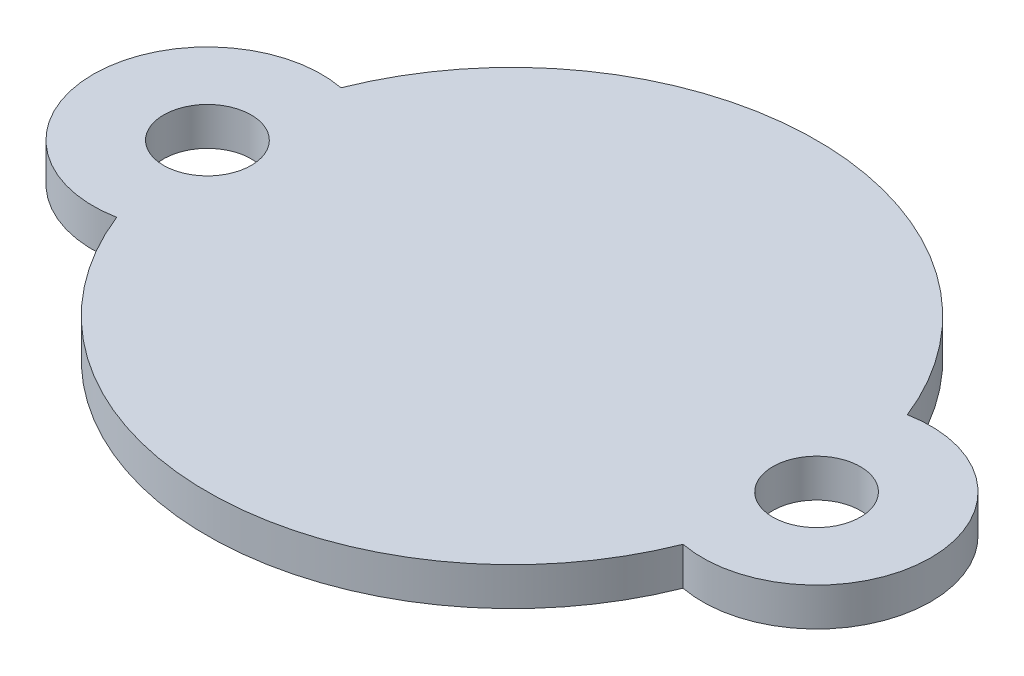
ISO-10303-21;
HEADER;
FILE_DESCRIPTION(('STEP AP214'),'2;1');
FILE_NAME('part.step','',(''),(''),'','','');
FILE_SCHEMA(('AUTOMOTIVE_DESIGN { 1 0 10303 214 1 1 1 1 }'));
ENDSEC;
DATA;
#1=APPLICATION_CONTEXT('core data for automotive mechanical design processes');
#2=APPLICATION_PROTOCOL_DEFINITION('international standard','automotive_design',2000,#1);
#3=PRODUCT_CONTEXT('',#1,'mechanical');
#4=PRODUCT('Part','Part','',(#3));
#5=PRODUCT_RELATED_PRODUCT_CATEGORY('part','',(#4));
#6=PRODUCT_DEFINITION_FORMATION('','',#4);
#7=PRODUCT_DEFINITION_CONTEXT('part definition',#1,'design');
#8=PRODUCT_DEFINITION('design','',#6,#7);
#9=PRODUCT_DEFINITION_SHAPE('','',#8);
#10=(LENGTH_UNIT() NAMED_UNIT(*) SI_UNIT(.MILLI.,.METRE.));
#11=(NAMED_UNIT(*) PLANE_ANGLE_UNIT() SI_UNIT($,.RADIAN.));
#12=(NAMED_UNIT(*) SI_UNIT($,.STERADIAN.) SOLID_ANGLE_UNIT());
#13=UNCERTAINTY_MEASURE_WITH_UNIT(LENGTH_MEASURE(1.E-05),#10,'distance_accuracy_value','');
#14=(GEOMETRIC_REPRESENTATION_CONTEXT(3) GLOBAL_UNCERTAINTY_ASSIGNED_CONTEXT((#13)) GLOBAL_UNIT_ASSIGNED_CONTEXT((#10,
#11,#12)) REPRESENTATION_CONTEXT('',''));
#15=CARTESIAN_POINT('',(0.,0.,0.));
#16=DIRECTION('',(0.,0.,1.));
#17=DIRECTION('',(1.,0.,0.));
#18=AXIS2_PLACEMENT_3D('',#15,#16,#17);
#19=CARTESIAN_POINT('',(-8.,1.,0.));
#20=DIRECTION('',(0.,-1.,0.));
#21=DIRECTION('',(0.,0.,-1.));
#22=AXIS2_PLACEMENT_3D('',#19,#20,#21);
#23=CYLINDRICAL_SURFACE('',#22,3.);
#24=CARTESIAN_POINT('',(-8.,0.,0.));
#25=DIRECTION('',(0.,1.,0.));
#26=DIRECTION('',(0.,0.,1.));
#27=AXIS2_PLACEMENT_3D('',#24,#25,#26);
#28=CIRCLE('',#27,3.);
#29=CARTESIAN_POINT('',(-7.4375,0.,-2.94679380853157));
#30=VERTEX_POINT('',#29);
#31=CARTESIAN_POINT('',(-7.4375,0.,2.94679380853157));
#32=VERTEX_POINT('',#31);
#33=EDGE_CURVE('E108',#30,#32,#28,.T.);
#34=ORIENTED_EDGE('',*,*,#33,.T.);
#35=DIRECTION('',(0.,-1.,0.));
#36=VECTOR('',#35,1.);
#37=CARTESIAN_POINT('',(-7.4375,1.,2.94679380853157));
#38=LINE('',#37,#36);
#39=CARTESIAN_POINT('',(-7.4375,1.,2.94679380853157));
#40=VERTEX_POINT('',#39);
#41=EDGE_CURVE('E11',#40,#32,#38,.T.);
#42=ORIENTED_EDGE('',*,*,#41,.F.);
#43=CARTESIAN_POINT('',(-8.,1.,0.));
#44=DIRECTION('',(0.,1.,0.));
#45=DIRECTION('',(0.,0.,1.));
#46=AXIS2_PLACEMENT_3D('',#43,#44,#45);
#47=CIRCLE('',#46,3.);
#48=CARTESIAN_POINT('',(-7.4375,1.,-2.94679380853157));
#49=VERTEX_POINT('',#48);
#50=EDGE_CURVE('E91',#49,#40,#47,.T.);
#51=ORIENTED_EDGE('',*,*,#50,.F.);
#52=DIRECTION('',(0.,-1.,0.));
#53=VECTOR('',#52,1.);
#54=CARTESIAN_POINT('',(-7.4375,1.,-2.94679380853157));
#55=LINE('',#54,#53);
#56=EDGE_CURVE('E107',#49,#30,#55,.T.);
#57=ORIENTED_EDGE('',*,*,#56,.T.);
#58=EDGE_LOOP('',(#34,#42,#51,#57));
#59=FACE_BOUND('',#58,.T.);
#60=ADVANCED_FACE('F39',(#59),#23,.T.);
#61=CARTESIAN_POINT('',(0.,1.,0.));
#62=DIRECTION('',(0.,-1.,0.));
#63=DIRECTION('',(0.,0.,-1.));
#64=AXIS2_PLACEMENT_3D('',#61,#62,#63);
#65=CYLINDRICAL_SURFACE('',#64,8.);
#66=CARTESIAN_POINT('',(0.,0.,0.));
#67=DIRECTION('',(0.,1.,0.));
#68=DIRECTION('',(0.,0.,1.));
#69=AXIS2_PLACEMENT_3D('',#66,#67,#68);
#70=CIRCLE('',#69,8.);
#71=CARTESIAN_POINT('',(7.4375,0.,2.94679380853157));
#72=VERTEX_POINT('',#71);
#73=EDGE_CURVE('E95',#32,#72,#70,.T.);
#74=ORIENTED_EDGE('',*,*,#73,.T.);
#75=DIRECTION('',(0.,-1.,0.));
#76=VECTOR('',#75,1.);
#77=CARTESIAN_POINT('',(7.4375,1.,2.94679380853157));
#78=LINE('',#77,#76);
#79=CARTESIAN_POINT('',(7.4375,1.,2.94679380853157));
#80=VERTEX_POINT('',#79);
#81=EDGE_CURVE('E47',#80,#72,#78,.T.);
#82=ORIENTED_EDGE('',*,*,#81,.F.);
#83=CARTESIAN_POINT('',(0.,1.,0.));
#84=DIRECTION('',(0.,1.,0.));
#85=DIRECTION('',(0.,0.,1.));
#86=AXIS2_PLACEMENT_3D('',#83,#84,#85);
#87=CIRCLE('',#86,8.);
#88=EDGE_CURVE('E85',#40,#80,#87,.T.);
#89=ORIENTED_EDGE('',*,*,#88,.F.);
#90=ORIENTED_EDGE('',*,*,#41,.T.);
#91=EDGE_LOOP('',(#74,#82,#89,#90));
#92=FACE_BOUND('',#91,.T.);
#93=ADVANCED_FACE('F94',(#92),#65,.T.);
#94=CARTESIAN_POINT('',(8.,1.,0.));
#95=DIRECTION('',(0.,-1.,0.));
#96=DIRECTION('',(0.,0.,-1.));
#97=AXIS2_PLACEMENT_3D('',#94,#95,#96);
#98=CYLINDRICAL_SURFACE('',#97,3.);
#99=CARTESIAN_POINT('',(8.,0.,0.));
#100=DIRECTION('',(0.,1.,0.));
#101=DIRECTION('',(0.,0.,1.));
#102=AXIS2_PLACEMENT_3D('',#99,#100,#101);
#103=CIRCLE('',#102,3.);
#104=CARTESIAN_POINT('',(7.4375,0.,-2.94679380853157));
#105=VERTEX_POINT('',#104);
#106=EDGE_CURVE('E72',#72,#105,#103,.T.);
#107=ORIENTED_EDGE('',*,*,#106,.T.);
#108=DIRECTION('',(0.,-1.,0.));
#109=VECTOR('',#108,1.);
#110=CARTESIAN_POINT('',(7.4375,1.,-2.94679380853157));
#111=LINE('',#110,#109);
#112=CARTESIAN_POINT('',(7.4375,1.,-2.94679380853157));
#113=VERTEX_POINT('',#112);
#114=EDGE_CURVE('E96',#113,#105,#111,.T.);
#115=ORIENTED_EDGE('',*,*,#114,.F.);
#116=CARTESIAN_POINT('',(8.,1.,0.));
#117=DIRECTION('',(0.,1.,0.));
#118=DIRECTION('',(0.,0.,1.));
#119=AXIS2_PLACEMENT_3D('',#116,#117,#118);
#120=CIRCLE('',#119,3.);
#121=EDGE_CURVE('E89',#80,#113,#120,.T.);
#122=ORIENTED_EDGE('',*,*,#121,.F.);
#123=ORIENTED_EDGE('',*,*,#81,.T.);
#124=EDGE_LOOP('',(#107,#115,#122,#123));
#125=FACE_BOUND('',#124,.T.);
#126=ADVANCED_FACE('F97',(#125),#98,.T.);
#127=CARTESIAN_POINT('',(-8.,1.,0.));
#128=DIRECTION('',(0.,-1.,0.));
#129=DIRECTION('',(0.,0.,-1.));
#130=AXIS2_PLACEMENT_3D('',#127,#128,#129);
#131=CYLINDRICAL_SURFACE('',#130,1.15);
#132=CARTESIAN_POINT('',(-8.,1.,0.));
#133=DIRECTION('',(0.,1.,0.));
#134=DIRECTION('',(0.,0.,1.));
#135=AXIS2_PLACEMENT_3D('',#132,#133,#134);
#136=CIRCLE('',#135,1.15);
#137=CARTESIAN_POINT('',(-8.,1.,1.15));
#138=VERTEX_POINT('',#137);
#139=EDGE_CURVE('E99',#138,#138,#136,.T.);
#140=ORIENTED_EDGE('',*,*,#139,.T.);
#141=EDGE_LOOP('',(#140));
#142=FACE_BOUND('',#141,.T.);
#143=CARTESIAN_POINT('',(-8.,0.,0.));
#144=DIRECTION('',(0.,1.,0.));
#145=DIRECTION('',(0.,0.,1.));
#146=AXIS2_PLACEMENT_3D('',#143,#144,#145);
#147=CIRCLE('',#146,1.15);
#148=CARTESIAN_POINT('',(-8.,0.,1.15));
#149=VERTEX_POINT('',#148);
#150=EDGE_CURVE('E113',#149,#149,#147,.T.);
#151=ORIENTED_EDGE('',*,*,#150,.F.);
#152=EDGE_LOOP('',(#151));
#153=FACE_BOUND('',#152,.T.);
#154=ADVANCED_FACE('F134',(#142,#153),#131,.F.);
#155=EDGE_CURVE('E78',#105,#30,#70,.T.);
#156=ORIENTED_EDGE('',*,*,#155,.T.);
#157=ORIENTED_EDGE('',*,*,#56,.F.);
#158=EDGE_CURVE('E55',#113,#49,#87,.T.);
#159=ORIENTED_EDGE('',*,*,#158,.F.);
#160=ORIENTED_EDGE('',*,*,#114,.T.);
#161=EDGE_LOOP('',(#156,#157,#159,#160));
#162=FACE_BOUND('',#161,.T.);
#163=ADVANCED_FACE('F120',(#162),#65,.T.);
#164=CARTESIAN_POINT('',(8.,1.,0.));
#165=DIRECTION('',(0.,-1.,0.));
#166=DIRECTION('',(0.,0.,-1.));
#167=AXIS2_PLACEMENT_3D('',#164,#165,#166);
#168=CYLINDRICAL_SURFACE('',#167,1.15);
#169=CARTESIAN_POINT('',(8.,1.,0.));
#170=DIRECTION('',(0.,1.,0.));
#171=DIRECTION('',(0.,0.,1.));
#172=AXIS2_PLACEMENT_3D('',#169,#170,#171);
#173=CIRCLE('',#172,1.15);
#174=CARTESIAN_POINT('',(8.,1.,1.15));
#175=VERTEX_POINT('',#174);
#176=EDGE_CURVE('E104',#175,#175,#173,.T.);
#177=ORIENTED_EDGE('',*,*,#176,.T.);
#178=EDGE_LOOP('',(#177));
#179=FACE_BOUND('',#178,.T.);
#180=CARTESIAN_POINT('',(8.,0.,0.));
#181=DIRECTION('',(0.,1.,0.));
#182=DIRECTION('',(0.,0.,1.));
#183=AXIS2_PLACEMENT_3D('',#180,#181,#182);
#184=CIRCLE('',#183,1.15);
#185=CARTESIAN_POINT('',(8.,0.,1.15));
#186=VERTEX_POINT('',#185);
#187=EDGE_CURVE('E116',#186,#186,#184,.T.);
#188=ORIENTED_EDGE('',*,*,#187,.F.);
#189=EDGE_LOOP('',(#188));
#190=FACE_BOUND('',#189,.T.);
#191=ADVANCED_FACE('F137',(#179,#190),#168,.F.);
#192=CARTESIAN_POINT('',(0.,1.,0.));
#193=DIRECTION('',(0.,1.,0.));
#194=DIRECTION('',(0.,0.,1.));
#195=AXIS2_PLACEMENT_3D('',#192,#193,#194);
#196=PLANE('',#195);
#197=ORIENTED_EDGE('',*,*,#50,.T.);
#198=ORIENTED_EDGE('',*,*,#88,.T.);
#199=ORIENTED_EDGE('',*,*,#121,.T.);
#200=ORIENTED_EDGE('',*,*,#158,.T.);
#201=EDGE_LOOP('',(#197,#198,#199,#200));
#202=FACE_BOUND('',#201,.T.);
#203=ORIENTED_EDGE('',*,*,#139,.F.);
#204=EDGE_LOOP('',(#203));
#205=FACE_BOUND('',#204,.T.);
#206=ORIENTED_EDGE('',*,*,#176,.F.);
#207=EDGE_LOOP('',(#206));
#208=FACE_BOUND('',#207,.T.);
#209=ADVANCED_FACE('F86',(#202,#205,#208),#196,.T.);
#210=CARTESIAN_POINT('',(0.,0.,0.));
#211=DIRECTION('',(0.,1.,0.));
#212=DIRECTION('',(0.,0.,1.));
#213=AXIS2_PLACEMENT_3D('',#210,#211,#212);
#214=PLANE('',#213);
#215=ORIENTED_EDGE('',*,*,#33,.F.);
#216=ORIENTED_EDGE('',*,*,#155,.F.);
#217=ORIENTED_EDGE('',*,*,#106,.F.);
#218=ORIENTED_EDGE('',*,*,#73,.F.);
#219=EDGE_LOOP('',(#215,#216,#217,#218));
#220=FACE_BOUND('',#219,.T.);
#221=ORIENTED_EDGE('',*,*,#150,.T.);
#222=EDGE_LOOP('',(#221));
#223=FACE_BOUND('',#222,.T.);
#224=ORIENTED_EDGE('',*,*,#187,.T.);
#225=EDGE_LOOP('',(#224));
#226=FACE_BOUND('',#225,.T.);
#227=ADVANCED_FACE('F123',(#220,#223,#226),#214,.F.);
#228=CLOSED_SHELL('',(#60,#93,#126,#154,#163,#191,#209,#227));
#229=MANIFOLD_SOLID_BREP('B2',#228);
#230=ADVANCED_BREP_SHAPE_REPRESENTATION('',(#18,#229),#14);
#231=SHAPE_DEFINITION_REPRESENTATION(#9,#230);
ENDSEC;
END-ISO-10303-21;
